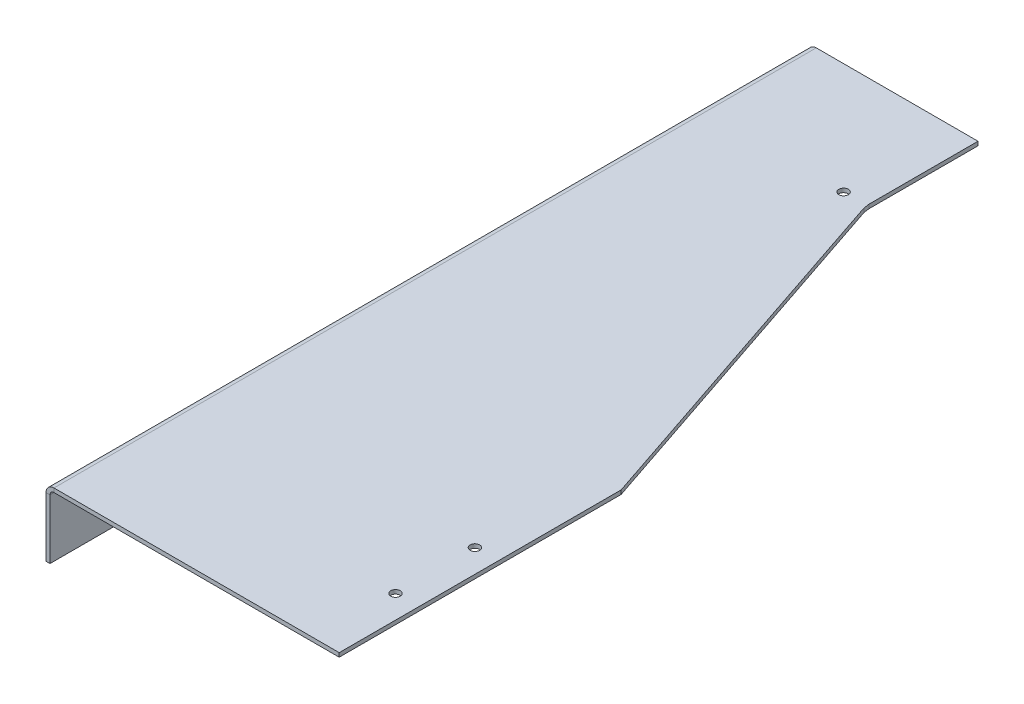
ISO-10303-21;
HEADER;
FILE_DESCRIPTION(('STEP AP214'),'2;1');
FILE_NAME('part.step','',(''),(''),'','','');
FILE_SCHEMA(('AUTOMOTIVE_DESIGN { 1 0 10303 214 1 1 1 1 }'));
ENDSEC;
DATA;
#1=APPLICATION_CONTEXT('core data for automotive mechanical design processes');
#2=APPLICATION_PROTOCOL_DEFINITION('international standard','automotive_design',2000,#1);
#3=PRODUCT_CONTEXT('',#1,'mechanical');
#4=PRODUCT('Part','Part','',(#3));
#5=PRODUCT_RELATED_PRODUCT_CATEGORY('part','',(#4));
#6=PRODUCT_DEFINITION_FORMATION('','',#4);
#7=PRODUCT_DEFINITION_CONTEXT('part definition',#1,'design');
#8=PRODUCT_DEFINITION('design','',#6,#7);
#9=PRODUCT_DEFINITION_SHAPE('','',#8);
#10=(LENGTH_UNIT() NAMED_UNIT(*) SI_UNIT(.MILLI.,.METRE.));
#11=(NAMED_UNIT(*) PLANE_ANGLE_UNIT() SI_UNIT($,.RADIAN.));
#12=(NAMED_UNIT(*) SI_UNIT($,.STERADIAN.) SOLID_ANGLE_UNIT());
#13=UNCERTAINTY_MEASURE_WITH_UNIT(LENGTH_MEASURE(1.E-05),#10,'distance_accuracy_value','');
#14=(GEOMETRIC_REPRESENTATION_CONTEXT(3) GLOBAL_UNCERTAINTY_ASSIGNED_CONTEXT((#13)) GLOBAL_UNIT_ASSIGNED_CONTEXT((#10,
#11,#12)) REPRESENTATION_CONTEXT('',''));
#15=CARTESIAN_POINT('',(0.,0.,0.));
#16=DIRECTION('',(0.,0.,1.));
#17=DIRECTION('',(1.,0.,0.));
#18=AXIS2_PLACEMENT_3D('',#15,#16,#17);
#19=CARTESIAN_POINT('',(0.,-1.5875,-304.8));
#20=DIRECTION('',(0.,0.,-1.));
#21=DIRECTION('',(-1.,0.,0.));
#22=AXIS2_PLACEMENT_3D('',#19,#20,#21);
#23=PLANE('',#22);
#24=DIRECTION('',(0.,1.,0.));
#25=VECTOR('',#24,1.);
#26=CARTESIAN_POINT('',(67.855905660295,-428.892143148937,-304.8));
#27=LINE('',#26,#25);
#28=CARTESIAN_POINT('',(67.855905660295,-1.5875,-304.8));
#29=VERTEX_POINT('',#28);
#30=CARTESIAN_POINT('',(67.855905660295,0.,-304.8));
#31=VERTEX_POINT('',#30);
#32=EDGE_CURVE('E184',#29,#31,#27,.T.);
#33=ORIENTED_EDGE('',*,*,#32,.F.);
#34=DIRECTION('',(-1.,0.,0.));
#35=VECTOR('',#34,1.);
#36=CARTESIAN_POINT('',(0.,-1.5875,-304.8));
#37=LINE('',#36,#35);
#38=CARTESIAN_POINT('',(3.18769999999999,-1.5875,-304.8));
#39=VERTEX_POINT('',#38);
#40=EDGE_CURVE('E149',#29,#39,#37,.T.);
#41=ORIENTED_EDGE('',*,*,#40,.T.);
#42=DIRECTION('',(0.,1.,0.));
#43=VECTOR('',#42,1.);
#44=CARTESIAN_POINT('',(3.18769999999999,-1.5875,-304.8));
#45=LINE('',#44,#43);
#46=CARTESIAN_POINT('',(3.1877,0.,-304.8));
#47=VERTEX_POINT('',#46);
#48=EDGE_CURVE('E236',#39,#47,#45,.T.);
#49=ORIENTED_EDGE('',*,*,#48,.T.);
#50=DIRECTION('',(-1.,0.,0.));
#51=VECTOR('',#50,1.);
#52=CARTESIAN_POINT('',(0.,0.,-304.8));
#53=LINE('',#52,#51);
#54=EDGE_CURVE('E150',#31,#47,#53,.T.);
#55=ORIENTED_EDGE('',*,*,#54,.F.);
#56=EDGE_LOOP('',(#33,#41,#49,#55));
#57=FACE_BOUND('',#56,.T.);
#58=ADVANCED_FACE('F59',(#57),#23,.T.);
#59=CARTESIAN_POINT('',(0.,-1.5875,0.));
#60=DIRECTION('',(0.,-1.,0.));
#61=DIRECTION('',(0.,0.,-1.));
#62=AXIS2_PLACEMENT_3D('',#59,#60,#61);
#63=PLANE('',#62);
#64=CARTESIAN_POINT('',(107.989583033638,-1.5875,-31.7500017642647));
#65=DIRECTION('',(0.,-1.,0.));
#66=DIRECTION('',(0.,0.,-1.));
#67=AXIS2_PLACEMENT_3D('',#64,#65,#66);
#68=CIRCLE('',#67,1.89864999999999);
#69=CARTESIAN_POINT('',(107.989583033638,-1.5875,-33.6486517642647));
#70=VERTEX_POINT('',#69);
#71=EDGE_CURVE('E490',#70,#70,#68,.T.);
#72=ORIENTED_EDGE('',*,*,#71,.F.);
#73=EDGE_LOOP('',(#72));
#74=FACE_BOUND('',#73,.T.);
#75=CARTESIAN_POINT('',(107.989583033639,-1.5875,-63.5000017642647));
#76=DIRECTION('',(0.,-1.,0.));
#77=DIRECTION('',(0.,0.,-1.));
#78=AXIS2_PLACEMENT_3D('',#75,#76,#77);
#79=CIRCLE('',#78,1.89864999999999);
#80=CARTESIAN_POINT('',(107.989583033639,-1.5875,-65.3986517642647));
#81=VERTEX_POINT('',#80);
#82=EDGE_CURVE('E500',#81,#81,#79,.T.);
#83=ORIENTED_EDGE('',*,*,#82,.F.);
#84=EDGE_LOOP('',(#83));
#85=FACE_BOUND('',#84,.T.);
#86=CARTESIAN_POINT('',(58.5643984245514,-1.5875,-260.349999741891));
#87=DIRECTION('',(0.,-1.,0.));
#88=DIRECTION('',(0.,0.,-1.));
#89=AXIS2_PLACEMENT_3D('',#86,#87,#88);
#90=CIRCLE('',#89,1.89864999999999);
#91=CARTESIAN_POINT('',(58.5643984245514,-1.5875,-262.248649741891));
#92=VERTEX_POINT('',#91);
#93=EDGE_CURVE('E506',#92,#92,#90,.T.);
#94=ORIENTED_EDGE('',*,*,#93,.F.);
#95=EDGE_LOOP('',(#94));
#96=FACE_BOUND('',#95,.T.);
#97=DIRECTION('',(0.,0.,-1.));
#98=VECTOR('',#97,1.);
#99=CARTESIAN_POINT('',(67.855905660295,-1.5875,0.));
#100=LINE('',#99,#98);
#101=CARTESIAN_POINT('',(67.855905660295,-1.5875,-261.227267276922));
#102=VERTEX_POINT('',#101);
#103=EDGE_CURVE('E74',#102,#29,#100,.T.);
#104=ORIENTED_EDGE('',*,*,#103,.F.);
#105=DIRECTION('',(-0.137693685970307,0.,-0.990474860278599));
#106=VECTOR('',#105,1.);
#107=CARTESIAN_POINT('',(102.196120413256,-1.5875,-14.2070849810449));
#108=LINE('',#107,#106);
#109=CARTESIAN_POINT('',(68.183918061223,-1.5875,-258.867768838854));
#110=VERTEX_POINT('',#109);
#111=EDGE_CURVE('E78',#110,#102,#108,.T.);
#112=ORIENTED_EDGE('',*,*,#111,.F.);
#113=DIRECTION('',(-0.318225860200851,0.,-0.948014927044627));
#114=VECTOR('',#113,1.);
#115=CARTESIAN_POINT('',(139.375059957347,-1.5875,-46.7848628541523));
#116=LINE('',#115,#114);
#117=CARTESIAN_POINT('',(117.240761896963,-1.5875,-112.724334107856));
#118=VERTEX_POINT('',#117);
#119=EDGE_CURVE('E155',#118,#110,#116,.T.);
#120=ORIENTED_EDGE('',*,*,#119,.F.);
#121=DIRECTION('',(0.,0.,-1.));
#122=VECTOR('',#121,1.);
#123=CARTESIAN_POINT('',(117.240761896963,-1.5875,0.));
#124=LINE('',#123,#122);
#125=CARTESIAN_POINT('',(117.240761896963,-1.58750000000002,0.));
#126=VERTEX_POINT('',#125);
#127=EDGE_CURVE('E153',#126,#118,#124,.T.);
#128=ORIENTED_EDGE('',*,*,#127,.F.);
#129=DIRECTION('',(1.,0.,0.));
#130=VECTOR('',#129,1.);
#131=CARTESIAN_POINT('',(152.4,-1.5875,0.));
#132=LINE('',#131,#130);
#133=CARTESIAN_POINT('',(3.18770000000004,-1.5875,0.));
#134=VERTEX_POINT('',#133);
#135=EDGE_CURVE('E139',#134,#126,#132,.T.);
#136=ORIENTED_EDGE('',*,*,#135,.F.);
#137=DIRECTION('',(0.,0.,-1.));
#138=VECTOR('',#137,1.);
#139=CARTESIAN_POINT('',(3.18769999999999,-1.5875,-304.8));
#140=LINE('',#139,#138);
#141=EDGE_CURVE('E242',#39,#134,#140,.F.);
#142=ORIENTED_EDGE('',*,*,#141,.F.);
#143=ORIENTED_EDGE('',*,*,#40,.F.);
#144=EDGE_LOOP('',(#104,#112,#120,#128,#136,#142,#143));
#145=FACE_BOUND('',#144,.T.);
#146=ADVANCED_FACE('F154',(#74,#85,#96,#145),#63,.T.);
#147=CARTESIAN_POINT('',(0.,0.,0.));
#148=DIRECTION('',(0.,-1.,0.));
#149=DIRECTION('',(0.,0.,-1.));
#150=AXIS2_PLACEMENT_3D('',#147,#148,#149);
#151=PLANE('',#150);
#152=CARTESIAN_POINT('',(107.989583033638,0.,-31.7500017642647));
#153=DIRECTION('',(0.,1.,0.));
#154=DIRECTION('',(0.,0.,1.));
#155=AXIS2_PLACEMENT_3D('',#152,#153,#154);
#156=CIRCLE('',#155,1.89864999999999);
#157=CARTESIAN_POINT('',(107.989583033638,0.,-29.8513517642647));
#158=VERTEX_POINT('',#157);
#159=EDGE_CURVE('E493',#158,#158,#156,.T.);
#160=ORIENTED_EDGE('',*,*,#159,.F.);
#161=EDGE_LOOP('',(#160));
#162=FACE_BOUND('',#161,.T.);
#163=CARTESIAN_POINT('',(107.989583033639,0.,-63.5000017642647));
#164=DIRECTION('',(0.,1.,0.));
#165=DIRECTION('',(0.,0.,1.));
#166=AXIS2_PLACEMENT_3D('',#163,#164,#165);
#167=CIRCLE('',#166,1.89864999999999);
#168=CARTESIAN_POINT('',(107.989583033639,0.,-61.6013517642647));
#169=VERTEX_POINT('',#168);
#170=EDGE_CURVE('E495',#169,#169,#167,.T.);
#171=ORIENTED_EDGE('',*,*,#170,.F.);
#172=EDGE_LOOP('',(#171));
#173=FACE_BOUND('',#172,.T.);
#174=CARTESIAN_POINT('',(58.5643984245514,0.,-260.349999741891));
#175=DIRECTION('',(0.,1.,0.));
#176=DIRECTION('',(0.,0.,1.));
#177=AXIS2_PLACEMENT_3D('',#174,#175,#176);
#178=CIRCLE('',#177,1.89864999999999);
#179=CARTESIAN_POINT('',(58.5643984245514,0.,-258.451349741891));
#180=VERTEX_POINT('',#179);
#181=EDGE_CURVE('E503',#180,#180,#178,.T.);
#182=ORIENTED_EDGE('',*,*,#181,.F.);
#183=EDGE_LOOP('',(#182));
#184=FACE_BOUND('',#183,.T.);
#185=DIRECTION('',(-0.137693685970307,0.,-0.990474860278599));
#186=VECTOR('',#185,1.);
#187=CARTESIAN_POINT('',(102.196120413256,0.,-14.2070849810449));
#188=LINE('',#187,#186);
#189=CARTESIAN_POINT('',(68.183918061223,0.,-258.867768838854));
#190=VERTEX_POINT('',#189);
#191=CARTESIAN_POINT('',(67.855905660295,0.,-261.227267276922));
#192=VERTEX_POINT('',#191);
#193=EDGE_CURVE('E67',#190,#192,#188,.T.);
#194=ORIENTED_EDGE('',*,*,#193,.T.);
#195=DIRECTION('',(0.,0.,-1.));
#196=VECTOR('',#195,1.);
#197=CARTESIAN_POINT('',(67.855905660295,0.,0.));
#198=LINE('',#197,#196);
#199=EDGE_CURVE('E13',#192,#31,#198,.T.);
#200=ORIENTED_EDGE('',*,*,#199,.T.);
#201=ORIENTED_EDGE('',*,*,#54,.T.);
#202=DIRECTION('',(0.,0.,-1.));
#203=VECTOR('',#202,1.);
#204=CARTESIAN_POINT('',(3.1877,0.,-304.8));
#205=LINE('',#204,#203);
#206=CARTESIAN_POINT('',(3.18770000000004,0.,0.));
#207=VERTEX_POINT('',#206);
#208=EDGE_CURVE('E230',#47,#207,#205,.F.);
#209=ORIENTED_EDGE('',*,*,#208,.T.);
#210=DIRECTION('',(1.,0.,0.));
#211=VECTOR('',#210,1.);
#212=CARTESIAN_POINT('',(152.4,0.,0.));
#213=LINE('',#212,#211);
#214=CARTESIAN_POINT('',(117.240761896963,0.,0.));
#215=VERTEX_POINT('',#214);
#216=EDGE_CURVE('E247',#207,#215,#213,.T.);
#217=ORIENTED_EDGE('',*,*,#216,.T.);
#218=DIRECTION('',(0.,0.,-1.));
#219=VECTOR('',#218,1.);
#220=CARTESIAN_POINT('',(117.240761896963,0.,0.));
#221=LINE('',#220,#219);
#222=CARTESIAN_POINT('',(117.240761896963,0.,-112.724334107856));
#223=VERTEX_POINT('',#222);
#224=EDGE_CURVE('E159',#215,#223,#221,.T.);
#225=ORIENTED_EDGE('',*,*,#224,.T.);
#226=DIRECTION('',(-0.318225860200851,0.,-0.948014927044626));
#227=VECTOR('',#226,1.);
#228=CARTESIAN_POINT('',(139.375059957347,0.,-46.7848628541523));
#229=LINE('',#228,#227);
#230=EDGE_CURVE('E163',#223,#190,#229,.T.);
#231=ORIENTED_EDGE('',*,*,#230,.T.);
#232=EDGE_LOOP('',(#194,#200,#201,#209,#217,#225,#231));
#233=FACE_BOUND('',#232,.T.);
#234=ADVANCED_FACE('F172',(#162,#173,#184,#233),#151,.F.);
#235=CARTESIAN_POINT('',(152.4,-1.5875,0.));
#236=DIRECTION('',(0.,0.,1.));
#237=DIRECTION('',(1.,0.,0.));
#238=AXIS2_PLACEMENT_3D('',#235,#236,#237);
#239=PLANE('',#238);
#240=DIRECTION('',(0.,-1.,0.));
#241=VECTOR('',#240,1.);
#242=CARTESIAN_POINT('',(117.240761896963,-1.5875,0.));
#243=LINE('',#242,#241);
#244=EDGE_CURVE('E143',#215,#126,#243,.T.);
#245=ORIENTED_EDGE('',*,*,#244,.F.);
#246=ORIENTED_EDGE('',*,*,#216,.F.);
#247=DIRECTION('',(0.,1.,0.));
#248=VECTOR('',#247,1.);
#249=CARTESIAN_POINT('',(3.18769999999999,-1.5875,-1.66533453693773E-13));
#250=LINE('',#249,#248);
#251=EDGE_CURVE('E146',#134,#207,#250,.T.);
#252=ORIENTED_EDGE('',*,*,#251,.F.);
#253=ORIENTED_EDGE('',*,*,#135,.T.);
#254=EDGE_LOOP('',(#245,#246,#252,#253));
#255=FACE_BOUND('',#254,.T.);
#256=ADVANCED_FACE('F61',(#255),#239,.T.);
#257=CARTESIAN_POINT('',(3.18769999999999,-3.1877,-1.11022302462516E-13));
#258=DIRECTION('',(0.,0.,1.));
#259=DIRECTION('',(1.,0.,0.));
#260=AXIS2_PLACEMENT_3D('',#257,#258,#259);
#261=PLANE('',#260);
#262=DIRECTION('',(-1.,0.,0.));
#263=VECTOR('',#262,1.);
#264=CARTESIAN_POINT('',(0.,-3.18769999999999,0.));
#265=LINE('',#264,#263);
#266=CARTESIAN_POINT('',(1.58749999999999,-3.18769999999999,-1.66533453693773E-13));
#267=VERTEX_POINT('',#266);
#268=CARTESIAN_POINT('',(0.,-3.18769999999999,-2.77555756156289E-13));
#269=VERTEX_POINT('',#268);
#270=EDGE_CURVE('E197',#267,#269,#265,.T.);
#271=ORIENTED_EDGE('',*,*,#270,.F.);
#272=CARTESIAN_POINT('',(3.18769999999999,-3.1877,-1.11022302462516E-13));
#273=DIRECTION('',(0.,0.,-1.));
#274=DIRECTION('',(-1.,0.,0.));
#275=AXIS2_PLACEMENT_3D('',#272,#273,#274);
#276=CIRCLE('',#275,1.6002);
#277=EDGE_CURVE('E239',#134,#267,#276,.F.);
#278=ORIENTED_EDGE('',*,*,#277,.F.);
#279=ORIENTED_EDGE('',*,*,#251,.T.);
#280=CARTESIAN_POINT('',(3.18769999999999,-3.1877,-2.77555756156289E-13));
#281=DIRECTION('',(0.,0.,-1.));
#282=DIRECTION('',(-1.,0.,0.));
#283=AXIS2_PLACEMENT_3D('',#280,#281,#282);
#284=CIRCLE('',#283,3.1877);
#285=EDGE_CURVE('E232',#207,#269,#284,.F.);
#286=ORIENTED_EDGE('',*,*,#285,.T.);
#287=EDGE_LOOP('',(#271,#278,#279,#286));
#288=FACE_BOUND('',#287,.T.);
#289=ADVANCED_FACE('F276',(#288),#261,.T.);
#290=CARTESIAN_POINT('',(3.18769999999999,-3.1877,-304.8));
#291=DIRECTION('',(0.,0.,1.));
#292=DIRECTION('',(1.,0.,0.));
#293=AXIS2_PLACEMENT_3D('',#290,#291,#292);
#294=PLANE('',#293);
#295=CARTESIAN_POINT('',(3.18769999999999,-3.1877,-304.8));
#296=DIRECTION('',(0.,0.,-1.));
#297=DIRECTION('',(-1.,0.,0.));
#298=AXIS2_PLACEMENT_3D('',#295,#296,#297);
#299=CIRCLE('',#298,1.6002);
#300=CARTESIAN_POINT('',(1.58749999999999,-3.18769999999999,-304.8));
#301=VERTEX_POINT('',#300);
#302=EDGE_CURVE('E200',#301,#39,#299,.T.);
#303=ORIENTED_EDGE('',*,*,#302,.F.);
#304=DIRECTION('',(-1.,0.,0.));
#305=VECTOR('',#304,1.);
#306=CARTESIAN_POINT('',(1.58749999999999,-3.18769999999999,-304.8));
#307=LINE('',#306,#305);
#308=CARTESIAN_POINT('',(0.,-3.18769999999999,-304.8));
#309=VERTEX_POINT('',#308);
#310=EDGE_CURVE('E223',#301,#309,#307,.T.);
#311=ORIENTED_EDGE('',*,*,#310,.T.);
#312=CARTESIAN_POINT('',(3.18769999999999,-3.1877,-304.8));
#313=DIRECTION('',(0.,0.,-1.));
#314=DIRECTION('',(-1.,0.,0.));
#315=AXIS2_PLACEMENT_3D('',#312,#313,#314);
#316=CIRCLE('',#315,3.1877);
#317=EDGE_CURVE('E233',#309,#47,#316,.T.);
#318=ORIENTED_EDGE('',*,*,#317,.T.);
#319=ORIENTED_EDGE('',*,*,#48,.F.);
#320=EDGE_LOOP('',(#303,#311,#318,#319));
#321=FACE_BOUND('',#320,.T.);
#322=ADVANCED_FACE('F257',(#321),#294,.F.);
#323=CARTESIAN_POINT('',(3.18769999999999,-3.1877,-304.8));
#324=DIRECTION('',(0.,0.,-1.));
#325=DIRECTION('',(-1.,0.,0.));
#326=AXIS2_PLACEMENT_3D('',#323,#324,#325);
#327=CYLINDRICAL_SURFACE('',#326,3.1877);
#328=ORIENTED_EDGE('',*,*,#208,.F.);
#329=ORIENTED_EDGE('',*,*,#317,.F.);
#330=DIRECTION('',(0.,0.,-1.));
#331=VECTOR('',#330,1.);
#332=CARTESIAN_POINT('',(0.,-3.18769999999999,0.));
#333=LINE('',#332,#331);
#334=EDGE_CURVE('E220',#269,#309,#333,.T.);
#335=ORIENTED_EDGE('',*,*,#334,.F.);
#336=ORIENTED_EDGE('',*,*,#285,.F.);
#337=EDGE_LOOP('',(#328,#329,#335,#336));
#338=FACE_BOUND('',#337,.T.);
#339=ADVANCED_FACE('F256',(#338),#327,.T.);
#340=CARTESIAN_POINT('',(3.18769999999999,-3.1877,-304.8));
#341=DIRECTION('',(0.,0.,-1.));
#342=DIRECTION('',(-1.,0.,0.));
#343=AXIS2_PLACEMENT_3D('',#340,#341,#342);
#344=CYLINDRICAL_SURFACE('',#343,1.6002);
#345=ORIENTED_EDGE('',*,*,#141,.T.);
#346=ORIENTED_EDGE('',*,*,#277,.T.);
#347=DIRECTION('',(0.,0.,1.));
#348=VECTOR('',#347,1.);
#349=CARTESIAN_POINT('',(1.58749999999999,-3.18769999999999,0.));
#350=LINE('',#349,#348);
#351=EDGE_CURVE('E226',#267,#301,#350,.F.);
#352=ORIENTED_EDGE('',*,*,#351,.T.);
#353=ORIENTED_EDGE('',*,*,#302,.T.);
#354=EDGE_LOOP('',(#345,#346,#352,#353));
#355=FACE_BOUND('',#354,.T.);
#356=ADVANCED_FACE('F279',(#355),#344,.F.);
#357=CARTESIAN_POINT('',(0.,-1.58749999999999,-304.8));
#358=DIRECTION('',(0.,0.,-1.));
#359=DIRECTION('',(0.,1.,0.));
#360=AXIS2_PLACEMENT_3D('',#357,#358,#359);
#361=PLANE('',#360);
#362=DIRECTION('',(0.,1.,0.));
#363=VECTOR('',#362,1.);
#364=CARTESIAN_POINT('',(0.,-1.58749999999999,-304.8));
#365=LINE('',#364,#363);
#366=CARTESIAN_POINT('',(0.,-26.9875,-304.8));
#367=VERTEX_POINT('',#366);
#368=EDGE_CURVE('E204',#367,#309,#365,.T.);
#369=ORIENTED_EDGE('',*,*,#368,.T.);
#370=ORIENTED_EDGE('',*,*,#310,.F.);
#371=DIRECTION('',(0.,-1.,0.));
#372=VECTOR('',#371,1.);
#373=CARTESIAN_POINT('',(1.58750000000001,-6.66133814775094E-13,-304.8));
#374=LINE('',#373,#372);
#375=CARTESIAN_POINT('',(1.58749999999991,-26.9875,-304.8));
#376=VERTEX_POINT('',#375);
#377=EDGE_CURVE('E212',#376,#301,#374,.F.);
#378=ORIENTED_EDGE('',*,*,#377,.F.);
#379=DIRECTION('',(1.,0.,0.));
#380=VECTOR('',#379,1.);
#381=CARTESIAN_POINT('',(0.,-26.9875,-304.8));
#382=LINE('',#381,#380);
#383=EDGE_CURVE('E198',#367,#376,#382,.T.);
#384=ORIENTED_EDGE('',*,*,#383,.F.);
#385=EDGE_LOOP('',(#369,#370,#378,#384));
#386=FACE_BOUND('',#385,.T.);
#387=ADVANCED_FACE('F266',(#386),#361,.T.);
#388=CARTESIAN_POINT('',(0.,-26.9875,0.));
#389=DIRECTION('',(0.,0.,1.));
#390=DIRECTION('',(1.,0.,0.));
#391=AXIS2_PLACEMENT_3D('',#388,#389,#390);
#392=PLANE('',#391);
#393=DIRECTION('',(0.,1.,0.));
#394=VECTOR('',#393,1.);
#395=CARTESIAN_POINT('',(1.58750000000001,0.,0.));
#396=LINE('',#395,#394);
#397=CARTESIAN_POINT('',(1.58749999999991,-26.9875,0.));
#398=VERTEX_POINT('',#397);
#399=EDGE_CURVE('E218',#267,#398,#396,.F.);
#400=ORIENTED_EDGE('',*,*,#399,.F.);
#401=ORIENTED_EDGE('',*,*,#270,.T.);
#402=DIRECTION('',(0.,-1.,0.));
#403=VECTOR('',#402,1.);
#404=CARTESIAN_POINT('',(0.,-26.9875,0.));
#405=LINE('',#404,#403);
#406=CARTESIAN_POINT('',(0.,-26.9875,0.));
#407=VERTEX_POINT('',#406);
#408=EDGE_CURVE('E210',#269,#407,#405,.T.);
#409=ORIENTED_EDGE('',*,*,#408,.T.);
#410=DIRECTION('',(1.,0.,0.));
#411=VECTOR('',#410,1.);
#412=CARTESIAN_POINT('',(0.,-26.9875,0.));
#413=LINE('',#412,#411);
#414=EDGE_CURVE('E201',#407,#398,#413,.T.);
#415=ORIENTED_EDGE('',*,*,#414,.T.);
#416=EDGE_LOOP('',(#400,#401,#409,#415));
#417=FACE_BOUND('',#416,.T.);
#418=ADVANCED_FACE('F273',(#417),#392,.T.);
#419=CARTESIAN_POINT('',(0.,0.,0.));
#420=DIRECTION('',(-1.,0.,0.));
#421=DIRECTION('',(0.,-1.,0.));
#422=AXIS2_PLACEMENT_3D('',#419,#420,#421);
#423=PLANE('',#422);
#424=ORIENTED_EDGE('',*,*,#408,.F.);
#425=ORIENTED_EDGE('',*,*,#334,.T.);
#426=ORIENTED_EDGE('',*,*,#368,.F.);
#427=DIRECTION('',(0.,0.,-1.));
#428=VECTOR('',#427,1.);
#429=CARTESIAN_POINT('',(0.,-26.9875,-304.8));
#430=LINE('',#429,#428);
#431=EDGE_CURVE('E207',#407,#367,#430,.T.);
#432=ORIENTED_EDGE('',*,*,#431,.F.);
#433=EDGE_LOOP('',(#424,#425,#426,#432));
#434=FACE_BOUND('',#433,.T.);
#435=ADVANCED_FACE('F264',(#434),#423,.T.);
#436=CARTESIAN_POINT('',(1.58750000000001,0.,0.));
#437=DIRECTION('',(-1.,0.,0.));
#438=DIRECTION('',(0.,-1.,0.));
#439=AXIS2_PLACEMENT_3D('',#436,#437,#438);
#440=PLANE('',#439);
#441=ORIENTED_EDGE('',*,*,#351,.F.);
#442=ORIENTED_EDGE('',*,*,#399,.T.);
#443=DIRECTION('',(0.,0.,1.));
#444=VECTOR('',#443,1.);
#445=CARTESIAN_POINT('',(1.58749999999991,-26.9875,0.));
#446=LINE('',#445,#444);
#447=EDGE_CURVE('E215',#398,#376,#446,.F.);
#448=ORIENTED_EDGE('',*,*,#447,.T.);
#449=ORIENTED_EDGE('',*,*,#377,.T.);
#450=EDGE_LOOP('',(#441,#442,#448,#449));
#451=FACE_BOUND('',#450,.T.);
#452=ADVANCED_FACE('F281',(#451),#440,.F.);
#453=CARTESIAN_POINT('',(0.,-26.9875,-304.8));
#454=DIRECTION('',(0.,-1.,0.));
#455=DIRECTION('',(1.,0.,0.));
#456=AXIS2_PLACEMENT_3D('',#453,#454,#455);
#457=PLANE('',#456);
#458=ORIENTED_EDGE('',*,*,#447,.F.);
#459=ORIENTED_EDGE('',*,*,#414,.F.);
#460=ORIENTED_EDGE('',*,*,#431,.T.);
#461=ORIENTED_EDGE('',*,*,#383,.T.);
#462=EDGE_LOOP('',(#458,#459,#460,#461));
#463=FACE_BOUND('',#462,.T.);
#464=ADVANCED_FACE('F270',(#463),#457,.T.);
#465=CARTESIAN_POINT('',(67.855905660295,-428.892143148937,-304.8));
#466=DIRECTION('',(-1.,0.,0.));
#467=DIRECTION('',(0.,0.,1.));
#468=AXIS2_PLACEMENT_3D('',#465,#466,#467);
#469=PLANE('',#468);
#470=DIRECTION('',(0.,1.,0.));
#471=VECTOR('',#470,1.);
#472=CARTESIAN_POINT('',(67.855905660295,-428.892143148937,-261.227267276922));
#473=LINE('',#472,#471);
#474=EDGE_CURVE('E183',#102,#192,#473,.T.);
#475=ORIENTED_EDGE('',*,*,#474,.F.);
#476=ORIENTED_EDGE('',*,*,#103,.T.);
#477=ORIENTED_EDGE('',*,*,#32,.T.);
#478=ORIENTED_EDGE('',*,*,#199,.F.);
#479=EDGE_LOOP('',(#475,#476,#477,#478));
#480=FACE_BOUND('',#479,.T.);
#481=ADVANCED_FACE('F182',(#480),#469,.F.);
#482=CARTESIAN_POINT('',(67.855905660295,-428.892143148937,-261.227267276922));
#483=DIRECTION('',(-0.990474860278599,0.,0.137693685970307));
#484=DIRECTION('',(0.137693685970307,0.,0.990474860278599));
#485=AXIS2_PLACEMENT_3D('',#482,#483,#484);
#486=PLANE('',#485);
#487=DIRECTION('',(0.,1.,0.));
#488=VECTOR('',#487,1.);
#489=CARTESIAN_POINT('',(68.1839180612229,-428.892143148937,-258.867768838854));
#490=LINE('',#489,#488);
#491=EDGE_CURVE('E186',#110,#190,#490,.T.);
#492=ORIENTED_EDGE('',*,*,#491,.F.);
#493=ORIENTED_EDGE('',*,*,#111,.T.);
#494=ORIENTED_EDGE('',*,*,#474,.T.);
#495=ORIENTED_EDGE('',*,*,#193,.F.);
#496=EDGE_LOOP('',(#492,#493,#494,#495));
#497=FACE_BOUND('',#496,.T.);
#498=ADVANCED_FACE('F185',(#497),#486,.F.);
#499=CARTESIAN_POINT('',(68.1839180612229,-428.892143148937,-258.867768838854));
#500=DIRECTION('',(-0.948014927044626,0.,0.318225860200851));
#501=DIRECTION('',(0.318225860200851,0.,0.948014927044627));
#502=AXIS2_PLACEMENT_3D('',#499,#500,#501);
#503=PLANE('',#502);
#504=ORIENTED_EDGE('',*,*,#491,.T.);
#505=ORIENTED_EDGE('',*,*,#230,.F.);
#506=DIRECTION('',(0.,1.,0.));
#507=VECTOR('',#506,1.);
#508=CARTESIAN_POINT('',(117.240761896963,-428.892143148937,-112.724334107856));
#509=LINE('',#508,#507);
#510=EDGE_CURVE('E189',#118,#223,#509,.T.);
#511=ORIENTED_EDGE('',*,*,#510,.F.);
#512=ORIENTED_EDGE('',*,*,#119,.T.);
#513=EDGE_LOOP('',(#504,#505,#511,#512));
#514=FACE_BOUND('',#513,.T.);
#515=ADVANCED_FACE('F351',(#514),#503,.F.);
#516=CARTESIAN_POINT('',(117.240761896963,-428.892143148937,-112.724334107856));
#517=DIRECTION('',(-1.,0.,0.));
#518=DIRECTION('',(0.,0.,1.));
#519=AXIS2_PLACEMENT_3D('',#516,#517,#518);
#520=PLANE('',#519);
#521=ORIENTED_EDGE('',*,*,#244,.T.);
#522=ORIENTED_EDGE('',*,*,#127,.T.);
#523=ORIENTED_EDGE('',*,*,#510,.T.);
#524=ORIENTED_EDGE('',*,*,#224,.F.);
#525=EDGE_LOOP('',(#521,#522,#523,#524));
#526=FACE_BOUND('',#525,.T.);
#527=ADVANCED_FACE('F162',(#526),#520,.F.);
#528=CARTESIAN_POINT('',(58.5643984245514,0.,-260.349999741891));
#529=DIRECTION('',(0.,1.,0.));
#530=DIRECTION('',(0.,0.,1.));
#531=AXIS2_PLACEMENT_3D('',#528,#529,#530);
#532=CYLINDRICAL_SURFACE('',#531,1.89864999999999);
#533=ORIENTED_EDGE('',*,*,#93,.T.);
#534=EDGE_LOOP('',(#533));
#535=FACE_BOUND('',#534,.T.);
#536=ORIENTED_EDGE('',*,*,#181,.T.);
#537=EDGE_LOOP('',(#536));
#538=FACE_BOUND('',#537,.T.);
#539=ADVANCED_FACE('F365',(#535,#538),#532,.F.);
#540=CARTESIAN_POINT('',(107.989583033639,0.,-63.5000017642647));
#541=DIRECTION('',(0.,1.,0.));
#542=DIRECTION('',(0.,0.,1.));
#543=AXIS2_PLACEMENT_3D('',#540,#541,#542);
#544=CYLINDRICAL_SURFACE('',#543,1.89864999999999);
#545=ORIENTED_EDGE('',*,*,#82,.T.);
#546=EDGE_LOOP('',(#545));
#547=FACE_BOUND('',#546,.T.);
#548=ORIENTED_EDGE('',*,*,#170,.T.);
#549=EDGE_LOOP('',(#548));
#550=FACE_BOUND('',#549,.T.);
#551=ADVANCED_FACE('F372',(#547,#550),#544,.F.);
#552=CARTESIAN_POINT('',(107.989583033638,0.,-31.7500017642647));
#553=DIRECTION('',(0.,1.,0.));
#554=DIRECTION('',(0.,0.,1.));
#555=AXIS2_PLACEMENT_3D('',#552,#553,#554);
#556=CYLINDRICAL_SURFACE('',#555,1.89864999999999);
#557=ORIENTED_EDGE('',*,*,#71,.T.);
#558=EDGE_LOOP('',(#557));
#559=FACE_BOUND('',#558,.T.);
#560=ORIENTED_EDGE('',*,*,#159,.T.);
#561=EDGE_LOOP('',(#560));
#562=FACE_BOUND('',#561,.T.);
#563=ADVANCED_FACE('F380',(#559,#562),#556,.F.);
#564=CLOSED_SHELL('',(#58,#146,#234,#256,#289,#322,#339,#356,#387,#418,#435,#452,#464,#481,#498,
#515,#527,#539,#551,#563));
#565=MANIFOLD_SOLID_BREP('B2',#564);
#566=ADVANCED_BREP_SHAPE_REPRESENTATION('',(#18,#565),#14);
#567=SHAPE_DEFINITION_REPRESENTATION(#9,#566);
ENDSEC;
END-ISO-10303-21;
